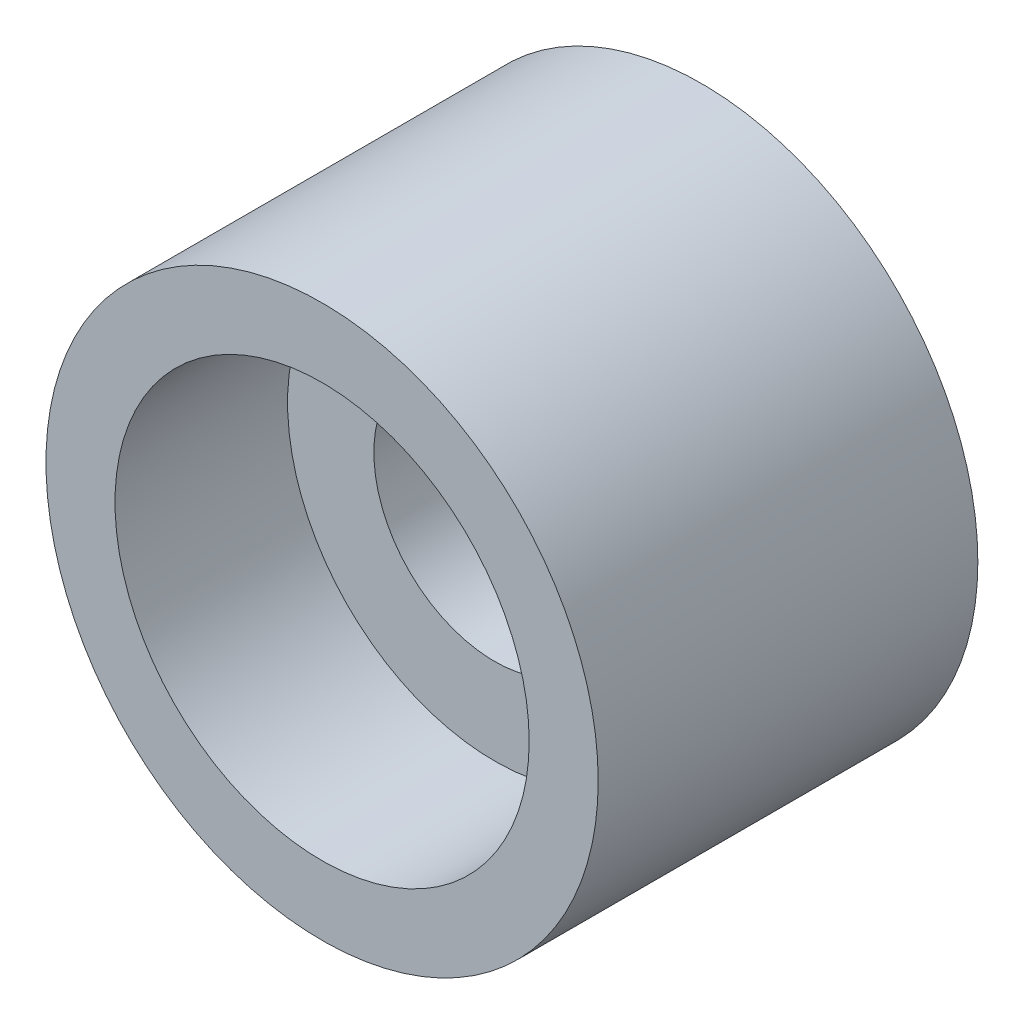
ISO-10303-21;
HEADER;
FILE_DESCRIPTION(('STEP AP214'),'2;1');
FILE_NAME('part.step','',(''),(''),'','','');
FILE_SCHEMA(('AUTOMOTIVE_DESIGN { 1 0 10303 214 1 1 1 1 }'));
ENDSEC;
DATA;
#1=APPLICATION_CONTEXT('core data for automotive mechanical design processes');
#2=APPLICATION_PROTOCOL_DEFINITION('international standard','automotive_design',2000,#1);
#3=PRODUCT_CONTEXT('',#1,'mechanical');
#4=PRODUCT('Part','Part','',(#3));
#5=PRODUCT_RELATED_PRODUCT_CATEGORY('part','',(#4));
#6=PRODUCT_DEFINITION_FORMATION('','',#4);
#7=PRODUCT_DEFINITION_CONTEXT('part definition',#1,'design');
#8=PRODUCT_DEFINITION('design','',#6,#7);
#9=PRODUCT_DEFINITION_SHAPE('','',#8);
#10=(LENGTH_UNIT() NAMED_UNIT(*) SI_UNIT(.MILLI.,.METRE.));
#11=(NAMED_UNIT(*) PLANE_ANGLE_UNIT() SI_UNIT($,.RADIAN.));
#12=(NAMED_UNIT(*) SI_UNIT($,.STERADIAN.) SOLID_ANGLE_UNIT());
#13=UNCERTAINTY_MEASURE_WITH_UNIT(LENGTH_MEASURE(1.E-05),#10,'distance_accuracy_value','');
#14=(GEOMETRIC_REPRESENTATION_CONTEXT(3) GLOBAL_UNCERTAINTY_ASSIGNED_CONTEXT((#13)) GLOBAL_UNIT_ASSIGNED_CONTEXT((#10,
#11,#12)) REPRESENTATION_CONTEXT('',''));
#15=CARTESIAN_POINT('',(0.,0.,0.));
#16=DIRECTION('',(0.,0.,1.));
#17=DIRECTION('',(1.,0.,0.));
#18=AXIS2_PLACEMENT_3D('',#15,#16,#17);
#19=CARTESIAN_POINT('',(0.,0.,3.));
#20=DIRECTION('',(0.,0.,1.));
#21=DIRECTION('',(1.,0.,0.));
#22=AXIS2_PLACEMENT_3D('',#19,#20,#21);
#23=PLANE('',#22);
#24=CARTESIAN_POINT('',(0.,0.,3.));
#25=DIRECTION('',(0.,0.,1.));
#26=DIRECTION('',(1.,0.,0.));
#27=AXIS2_PLACEMENT_3D('',#24,#25,#26);
#28=CIRCLE('',#27,3.);
#29=CARTESIAN_POINT('',(3.,0.,3.));
#30=VERTEX_POINT('',#29);
#31=EDGE_CURVE('E10',#30,#30,#28,.F.);
#32=ORIENTED_EDGE('',*,*,#31,.F.);
#33=EDGE_LOOP('',(#32));
#34=FACE_BOUND('',#33,.T.);
#35=CARTESIAN_POINT('',(0.,0.,3.));
#36=DIRECTION('',(0.,0.,1.));
#37=DIRECTION('',(1.,0.,0.));
#38=AXIS2_PLACEMENT_3D('',#35,#36,#37);
#39=CIRCLE('',#38,1.75);
#40=CARTESIAN_POINT('',(1.75,0.,3.));
#41=VERTEX_POINT('',#40);
#42=EDGE_CURVE('E43',#41,#41,#39,.T.);
#43=ORIENTED_EDGE('',*,*,#42,.F.);
#44=EDGE_LOOP('',(#43));
#45=FACE_BOUND('',#44,.T.);
#46=ADVANCED_FACE('F31',(#34,#45),#23,.T.);
#47=CARTESIAN_POINT('',(0.,0.,0.));
#48=DIRECTION('',(0.,0.,1.));
#49=DIRECTION('',(1.,0.,0.));
#50=AXIS2_PLACEMENT_3D('',#47,#48,#49);
#51=PLANE('',#50);
#52=CARTESIAN_POINT('',(0.,0.,0.));
#53=DIRECTION('',(0.,0.,1.));
#54=DIRECTION('',(1.,0.,0.));
#55=AXIS2_PLACEMENT_3D('',#52,#53,#54);
#56=CIRCLE('',#55,4.);
#57=CARTESIAN_POINT('',(4.,0.,0.));
#58=VERTEX_POINT('',#57);
#59=EDGE_CURVE('E39',#58,#58,#56,.T.);
#60=ORIENTED_EDGE('',*,*,#59,.F.);
#61=EDGE_LOOP('',(#60));
#62=FACE_BOUND('',#61,.T.);
#63=CARTESIAN_POINT('',(0.,0.,0.));
#64=DIRECTION('',(0.,0.,1.));
#65=DIRECTION('',(1.,0.,0.));
#66=AXIS2_PLACEMENT_3D('',#63,#64,#65);
#67=CIRCLE('',#66,1.75);
#68=CARTESIAN_POINT('',(1.75,0.,0.));
#69=VERTEX_POINT('',#68);
#70=EDGE_CURVE('E47',#69,#69,#67,.T.);
#71=ORIENTED_EDGE('',*,*,#70,.T.);
#72=EDGE_LOOP('',(#71));
#73=FACE_BOUND('',#72,.T.);
#74=ADVANCED_FACE('F88',(#62,#73),#51,.F.);
#75=CARTESIAN_POINT('',(0.,0.,3.));
#76=DIRECTION('',(0.,0.,-1.));
#77=DIRECTION('',(-1.,0.,0.));
#78=AXIS2_PLACEMENT_3D('',#75,#76,#77);
#79=CYLINDRICAL_SURFACE('',#78,4.);
#80=CARTESIAN_POINT('',(0.932613213836867,-3.88975996603606,1.5));
#81=CARTESIAN_POINT('',(0.932611601497733,-3.88976090522241,1.45554849961442));
#82=CARTESIAN_POINT('',(0.928923852394566,-3.89065022868961,1.41107630135481));
#83=CARTESIAN_POINT('',(0.91428040517545,-3.89411682507593,1.32338999590528));
#84=CARTESIAN_POINT('',(0.903318891538184,-3.89669544860345,1.28017692429515));
#85=CARTESIAN_POINT('',(0.87447501795473,-3.9032692191638,1.19629015730966));
#86=CARTESIAN_POINT('',(0.856599541703767,-3.90726295694658,1.15561398277206));
#87=CARTESIAN_POINT('',(0.814444378892575,-3.91626643942841,1.07786012424431));
#88=CARTESIAN_POINT('',(0.7901650497694,-3.92127612741763,1.04078223957019));
#89=CARTESIAN_POINT('',(0.735513519829643,-3.93189552304348,0.970751196916405));
#90=CARTESIAN_POINT('',(0.705067935082605,-3.93751203605064,0.937856329692689));
#91=CARTESIAN_POINT('',(0.639092602583028,-3.94875656510582,0.877633973136957));
#92=CARTESIAN_POINT('',(0.603562498738439,-3.95438458193228,0.850306874066288));
#93=CARTESIAN_POINT('',(0.5280298571732,-3.96517972488418,0.801769585897201));
#94=CARTESIAN_POINT('',(0.487991036216633,-3.97034240623526,0.780614788946684));
#95=CARTESIAN_POINT('',(0.404805514234827,-3.97968365160796,0.745380050361506));
#96=CARTESIAN_POINT('',(0.361659104557738,-3.98386230772923,0.731299446479216));
#97=CARTESIAN_POINT('',(0.274078958291291,-3.99083752834648,0.710794245104304));
#98=CARTESIAN_POINT('',(0.229669673579582,-3.99365157759681,0.7042712179432));
#99=CARTESIAN_POINT('',(0.140319269550402,-3.99778810384624,0.698759238529355));
#100=CARTESIAN_POINT('',(0.0953782018979144,-3.99911072456104,0.699769560283349));
#101=CARTESIAN_POINT('',(0.00691698313752567,-4.00023525260167,0.70922094417245));
#102=CARTESIAN_POINT('',(-0.0366142888927465,-4.00005854787314,0.717555981734285));
#103=CARTESIAN_POINT('',(-0.121692041237425,-3.99837499290008,0.74125202596712));
#104=CARTESIAN_POINT('',(-0.163238442065054,-3.99686808943297,0.756613313753505));
#105=CARTESIAN_POINT('',(-0.243462251550346,-3.99278738692268,0.79402403211782));
#106=CARTESIAN_POINT('',(-0.282119930010285,-3.99020692421686,0.816115000883916));
#107=CARTESIAN_POINT('',(-0.355241208099461,-3.98436333258035,0.866327261789285));
#108=CARTESIAN_POINT('',(-0.389704324415097,-3.98110012509873,0.894449247816418));
#109=CARTESIAN_POINT('',(-0.454077771003557,-3.97427743700286,0.956506897686783));
#110=CARTESIAN_POINT('',(-0.483898277287227,-3.97071378376234,0.990535349383676));
#111=CARTESIAN_POINT('',(-0.537414351878906,-3.9638259328621,1.06313315396061));
#112=CARTESIAN_POINT('',(-0.561109804340658,-3.96050173973228,1.10170259270656));
#113=CARTESIAN_POINT('',(-0.601722329335953,-3.95453593799222,1.18241666545745));
#114=CARTESIAN_POINT('',(-0.618624786886195,-3.95189580541074,1.22456877411173));
#115=CARTESIAN_POINT('',(-0.645042449625944,-3.94767032949601,1.31117705897919));
#116=CARTESIAN_POINT('',(-0.654558617602301,-3.94608484869504,1.35563293409527));
#117=CARTESIAN_POINT('',(-0.665792613018097,-3.94420491939814,1.44477188639924));
#118=CARTESIAN_POINT('',(-0.667641093419723,-3.94388884396406,1.48943805944827));
#119=CARTESIAN_POINT('',(-0.663837719081638,-3.94453078092343,1.57843857855975));
#120=CARTESIAN_POINT('',(-0.65818628964889,-3.94548872106965,1.62277294329509));
#121=CARTESIAN_POINT('',(-0.639659509778759,-3.94853410110952,1.70941491223379));
#122=CARTESIAN_POINT('',(-0.626853948425632,-3.95061062226391,1.75173787442861));
#123=CARTESIAN_POINT('',(-0.594464127320188,-3.95561364473294,1.83365062322299));
#124=CARTESIAN_POINT('',(-0.574879309156978,-3.95854021606346,1.87324018434857));
#125=CARTESIAN_POINT('',(-0.529201449660236,-3.96490636453741,1.94913048796013));
#126=CARTESIAN_POINT('',(-0.503026905560537,-3.96835213114539,1.98538163704066));
#127=CARTESIAN_POINT('',(-0.445034064735638,-3.97527301087596,2.05304664960073));
#128=CARTESIAN_POINT('',(-0.413215187149352,-3.97874812698383,2.0844600145994));
#129=CARTESIAN_POINT('',(-0.344264510899848,-3.98531017978837,2.14205004734846));
#130=CARTESIAN_POINT('',(-0.30705865168011,-3.98839033860635,2.16813892371999));
#131=CARTESIAN_POINT('',(-0.228743331296409,-3.99364675951559,2.21371670519966));
#132=CARTESIAN_POINT('',(-0.187634034158392,-3.99582305956716,2.23320588747582));
#133=CARTESIAN_POINT('',(-0.102920273262336,-3.99889884133192,2.2649030973973));
#134=CARTESIAN_POINT('',(-0.0593315441801701,-3.99980560472754,2.27715241458099));
#135=CARTESIAN_POINT('',(0.0292886173209452,-4.00013798401781,2.29415299813107));
#136=CARTESIAN_POINT('',(0.0743198753105035,-3.99956377832735,2.29890516758054));
#137=CARTESIAN_POINT('',(0.163705871825794,-3.99689445877422,2.3007415847703));
#138=CARTESIAN_POINT('',(0.20805874708385,-3.99482598436423,2.29795782436496));
#139=CARTESIAN_POINT('',(0.295602691712552,-3.98930359594298,2.28509283956174));
#140=CARTESIAN_POINT('',(0.33879377568456,-3.98584969935236,2.27501170692153));
#141=CARTESIAN_POINT('',(0.422711597978297,-3.97782467668736,2.24789680632668));
#142=CARTESIAN_POINT('',(0.46344371580826,-3.97325610851898,2.23087889749505));
#143=CARTESIAN_POINT('',(0.541464315888177,-3.9633779292023,2.19039020693527));
#144=CARTESIAN_POINT('',(0.578752525697985,-3.95806825951034,2.16691891527702));
#145=CARTESIAN_POINT('',(0.649487474523809,-3.94708366104805,2.11374449035033));
#146=CARTESIAN_POINT('',(0.682862536853944,-3.94140422163191,2.08394693089058));
#147=CARTESIAN_POINT('',(0.744186754342728,-3.93028748483718,2.01915980792338));
#148=CARTESIAN_POINT('',(0.772134622569896,-3.92485024512554,1.98416901642501));
#149=CARTESIAN_POINT('',(0.822109747379236,-3.91468960137373,1.90953654663985));
#150=CARTESIAN_POINT('',(0.844069987321351,-3.90997451728596,1.8698488310717));
#151=CARTESIAN_POINT('',(0.881012102193239,-3.90181732541837,1.78725378136024));
#152=CARTESIAN_POINT('',(0.896000307366474,-3.89837406347789,1.74434940904166));
#153=CARTESIAN_POINT('',(0.915675640286949,-3.893791260574,1.66779003565074));
#154=CARTESIAN_POINT('',(0.922016058450731,-3.8922879373223,1.63457166439083));
#155=CARTESIAN_POINT('',(0.930485385487263,-3.89027195014103,1.56757283635709));
#156=CARTESIAN_POINT('',(0.93261443955044,-3.88975925205882,1.53379239900146));
#157=CARTESIAN_POINT('',(0.932613213836867,-3.88975996603606,1.5));
#158=B_SPLINE_CURVE_WITH_KNOTS('',3,(#80,#81,#82,#83,#84,#85,#86,#87,#88,#89,#90,#91,#92,#93,
#94,#95,#96,#97,#98,#99,#100,#101,#102,#103,#104,#105,#106,#107,#108,#109,#110,#111,#112,#113,
#114,#115,#116,#117,#118,#119,#120,#121,#122,#123,#124,#125,#126,#127,#128,#129,#130,#131,#132,
#133,#134,#135,#136,#137,#138,#139,#140,#141,#142,#143,#144,#145,#146,#147,#148,#149,#150,#151,
#152,#153,#154,#155,#156,#157),.UNSPECIFIED.,.T.,.F.,(4,2,2,2,2,2,2,2,2,2,2,2,2,2,2,2,2,2,2,2,2,
2,2,2,2,2,2,2,2,2,2,2,2,2,2,2,2,2,4),(0.,0.133230771085219,0.26656819140741,0.399773198332441,
0.532970771867862,0.667858020367463,0.802754720263344,0.938827203479569,1.07488694595244,
1.20915399104461,1.34340809690995,1.47575031704826,1.60809783256996,1.74127939375839,
1.87447628614049,2.00999477407982,2.14551582496172,2.28132690536217,2.41712028010815,
2.5505900624167,2.68405227620732,2.8162347342465,2.94842808281514,3.08234447817612,
3.21627466294162,3.35226081384755,3.48824125302078,3.62343850860915,3.75861947751297,
3.89144813929743,4.024275130914,4.15680013658356,4.28933561705741,4.42400921618471,
4.55871471109819,4.69487118861227,4.8309038006914,4.9321904290751,5.03347356545365),.UNSPECIFIED.);
#159=CARTESIAN_POINT('',(0.932613213836867,-3.88975996603606,1.5));
#160=VERTEX_POINT('',#159);
#161=EDGE_CURVE('E58',#160,#160,#158,.T.);
#162=ORIENTED_EDGE('',*,*,#161,.T.);
#163=EDGE_LOOP('',(#162));
#164=FACE_BOUND('',#163,.T.);
#165=ORIENTED_EDGE('',*,*,#59,.T.);
#166=EDGE_LOOP('',(#165));
#167=FACE_BOUND('',#166,.T.);
#168=CARTESIAN_POINT('',(0.,0.,5.5));
#169=DIRECTION('',(0.,0.,1.));
#170=DIRECTION('',(1.,0.,0.));
#171=AXIS2_PLACEMENT_3D('',#168,#169,#170);
#172=CIRCLE('',#171,4.);
#173=CARTESIAN_POINT('',(4.,0.,5.5));
#174=VERTEX_POINT('',#173);
#175=EDGE_CURVE('E51',#174,#174,#172,.T.);
#176=ORIENTED_EDGE('',*,*,#175,.F.);
#177=EDGE_LOOP('',(#176));
#178=FACE_BOUND('',#177,.T.);
#179=ADVANCED_FACE('F33',(#164,#167,#178),#79,.T.);
#180=CARTESIAN_POINT('',(0.,0.,3.));
#181=DIRECTION('',(0.,0.,-1.));
#182=DIRECTION('',(-1.,0.,0.));
#183=AXIS2_PLACEMENT_3D('',#180,#181,#182);
#184=CYLINDRICAL_SURFACE('',#183,1.75);
#185=CARTESIAN_POINT('',(0.852387018232029,-1.52837703828261,1.5));
#186=CARTESIAN_POINT('',(0.852384817945411,-1.52837970281062,1.45778495316443));
#187=CARTESIAN_POINT('',(0.84908513062133,-1.53023293278412,1.41550472635909));
#188=CARTESIAN_POINT('',(0.836030336875847,-1.5374022877934,1.33220020462497));
#189=CARTESIAN_POINT('',(0.826259454723989,-1.54272687494199,1.29117923591791));
#190=CARTESIAN_POINT('',(0.800728289470568,-1.55612951149121,1.21175012983708));
#191=CARTESIAN_POINT('',(0.784995815817549,-1.56419475857854,1.17333082252635));
#192=CARTESIAN_POINT('',(0.748050996116917,-1.58219483528755,1.0997308270703));
#193=CARTESIAN_POINT('',(0.726839180206835,-1.59212948401556,1.06454982605862));
#194=CARTESIAN_POINT('',(0.677807420609522,-1.61364201019623,0.99575893399544));
#195=CARTESIAN_POINT('',(0.649634869972045,-1.62528579326483,0.962420848079775));
#196=CARTESIAN_POINT('',(0.588176889562603,-1.64852269956874,0.900800404006014));
#197=CARTESIAN_POINT('',(0.554889251545673,-1.66011579868944,0.872520240879173));
#198=CARTESIAN_POINT('',(0.481908996684588,-1.68279508732706,0.820329014570099));
#199=CARTESIAN_POINT('',(0.441967294677159,-1.6938199207277,0.796737096720972));
#200=CARTESIAN_POINT('',(0.358081493367781,-1.71351363232638,0.756787577891677));
#201=CARTESIAN_POINT('',(0.314139530640908,-1.7221837584513,0.740426142069765));
#202=CARTESIAN_POINT('',(0.226331671335239,-1.73583572138983,0.716428991503449));
#203=CARTESIAN_POINT('',(0.182625407573443,-1.74101066235729,0.70832091629485));
#204=CARTESIAN_POINT('',(0.0942169219672954,-1.74802334838509,0.699520671848029));
#205=CARTESIAN_POINT('',(0.0495152041392732,-1.74986274507678,0.698824831527908));
#206=CARTESIAN_POINT('',(-0.036126724724031,-1.75011307138237,0.704651290245846));
#207=CARTESIAN_POINT('',(-0.0771033442098851,-1.74876443818711,0.710650460537884));
#208=CARTESIAN_POINT('',(-0.157484817257746,-1.7433650546478,0.728781699015403));
#209=CARTESIAN_POINT('',(-0.196889554002377,-1.73931410387104,0.740914222099623));
#210=CARTESIAN_POINT('',(-0.273724621224476,-1.72890196228755,0.771089453362653));
#211=CARTESIAN_POINT('',(-0.311116178181164,-1.72250682758488,0.789218595744018));
#212=CARTESIAN_POINT('',(-0.38248021627184,-1.70807971747166,0.830775255886455));
#213=CARTESIAN_POINT('',(-0.416451437646712,-1.70004714223883,0.854204715589977));
#214=CARTESIAN_POINT('',(-0.482968468637708,-1.68241516132379,0.907926573800167));
#215=CARTESIAN_POINT('',(-0.515166945002259,-1.67274121507567,0.938625065477214));
#216=CARTESIAN_POINT('',(-0.574128997336013,-1.6534329165143,1.00489926868235));
#217=CARTESIAN_POINT('',(-0.6008895585813,-1.64379858904916,1.04047766737395));
#218=CARTESIAN_POINT('',(-0.64937298702756,-1.6252754481917,1.11754261290331));
#219=CARTESIAN_POINT('',(-0.67080634870494,-1.61644156418817,1.15922605233847));
#220=CARTESIAN_POINT('',(-0.706114690380789,-1.60133537777784,1.24610620459552));
#221=CARTESIAN_POINT('',(-0.719996322124462,-1.59506082227611,1.29129978536512));
#222=CARTESIAN_POINT('',(-0.738779827374733,-1.58644394299812,1.38040861617786));
#223=CARTESIAN_POINT('',(-0.744263960312272,-1.58384769442957,1.42417580219255));
#224=CARTESIAN_POINT('',(-0.74782462900088,-1.58217056833844,1.51206878521202));
#225=CARTESIAN_POINT('',(-0.745904742212474,-1.58308799308422,1.55619439875013));
#226=CARTESIAN_POINT('',(-0.735249411903947,-1.58806058078048,1.63963049883396));
#227=CARTESIAN_POINT('',(-0.727099130850528,-1.59184611128256,1.67903442933608));
#228=CARTESIAN_POINT('',(-0.705044011362558,-1.60173589348558,1.75588706362019));
#229=CARTESIAN_POINT('',(-0.691137627714577,-1.60784076777323,1.79333523934168));
#230=CARTESIAN_POINT('',(-0.657294101934859,-1.62197848214374,1.86713212438687));
#231=CARTESIAN_POINT('',(-0.637111178660018,-1.63008645539336,1.9033531187921));
#232=CARTESIAN_POINT('',(-0.591542134457451,-1.64717017717172,1.9721363993463));
#233=CARTESIAN_POINT('',(-0.566153491461446,-1.6561463452059,2.00469690017507));
#234=CARTESIAN_POINT('',(-0.507891280571864,-1.67498503436728,2.06868884695913));
#235=CARTESIAN_POINT('',(-0.474519226703814,-1.68484491425638,2.09966916202273));
#236=CARTESIAN_POINT('',(-0.40285754277046,-1.70340094523157,2.15575887406282));
#237=CARTESIAN_POINT('',(-0.364567034877234,-1.71209688801526,2.18086722076975));
#238=CARTESIAN_POINT('',(-0.283471926074788,-1.72738645778073,2.22469806954343));
#239=CARTESIAN_POINT('',(-0.24061906320337,-1.7339538571942,2.24334108924826));
#240=CARTESIAN_POINT('',(-0.152018432046977,-1.74395295671062,2.27303205208709));
#241=CARTESIAN_POINT('',(-0.106272802060194,-1.74738694467958,2.28408553527288));
#242=CARTESIAN_POINT('',(-0.0171950333652808,-1.75043659178132,2.29748671886674));
#243=CARTESIAN_POINT('',(0.0260325717100333,-1.75033893290961,2.30046691262322));
#244=CARTESIAN_POINT('',(0.112269274128942,-1.74692751394537,2.29941457618845));
#245=CARTESIAN_POINT('',(0.155278422602751,-1.74361454490998,2.29538377070787));
#246=CARTESIAN_POINT('',(0.237674437007281,-1.73425722419483,2.28087100150947));
#247=CARTESIAN_POINT('',(0.277135615803498,-1.72835421658063,2.27071381855106));
#248=CARTESIAN_POINT('',(0.353677006258787,-1.71433011927701,2.24462857351464));
#249=CARTESIAN_POINT('',(0.390756816386293,-1.70620865673198,2.22869954121511));
#250=CARTESIAN_POINT('',(0.463377012023179,-1.68797140218873,2.1907295878475));
#251=CARTESIAN_POINT('',(0.498769729629919,-1.6777814625959,2.16844273884388));
#252=CARTESIAN_POINT('',(0.565432651099769,-1.65650606172437,2.11872040252548));
#253=CARTESIAN_POINT('',(0.59670103014971,-1.64542020752341,2.09128264911733));
#254=CARTESIAN_POINT('',(0.656989283529083,-1.62234161461272,2.02935175203626));
#255=CARTESIAN_POINT('',(0.685602080212933,-1.61035061106202,1.99446035144067));
#256=CARTESIAN_POINT('',(0.73670246979574,-1.58762527738422,1.92003304463252));
#257=CARTESIAN_POINT('',(0.759185965124275,-1.5768917906546,1.88049405655736));
#258=CARTESIAN_POINT('',(0.797497702313922,-1.55787072623172,1.79729319130993));
#259=CARTESIAN_POINT('',(0.813263665919663,-1.54960624041214,1.75359714062442));
#260=CARTESIAN_POINT('',(0.83710902870861,-1.5368593643989,1.66371027870467));
#261=CARTESIAN_POINT('',(0.845214231246459,-1.53236428372129,1.61752840002367));
#262=CARTESIAN_POINT('',(0.85032168619523,-1.52952704783178,1.55917862715732));
#263=CARTESIAN_POINT('',(0.851095360286664,-1.5290967884062,1.54736195279184));
#264=CARTESIAN_POINT('',(0.852128344911047,-1.52852140419915,1.5236985655321));
#265=CARTESIAN_POINT('',(0.852387635961304,-1.52837629021781,1.51185185151707));
#266=CARTESIAN_POINT('',(0.852387018232029,-1.52837703828261,1.5));
#267=B_SPLINE_CURVE_WITH_KNOTS('',3,(#185,#186,#187,#188,#189,#190,#191,#192,#193,#194,#195,
#196,#197,#198,#199,#200,#201,#202,#203,#204,#205,#206,#207,#208,#209,#210,#211,#212,#213,#214,
#215,#216,#217,#218,#219,#220,#221,#222,#223,#224,#225,#226,#227,#228,#229,#230,#231,#232,#233,
#234,#235,#236,#237,#238,#239,#240,#241,#242,#243,#244,#245,#246,#247,#248,#249,#250,#251,#252,
#253,#254,#255,#256,#257,#258,#259,#260,#261,#262,#263,#264,#265,#266),.UNSPECIFIED.,.T.,.F.,(4,
2,2,2,2,2,2,2,2,2,2,2,2,2,2,2,2,2,2,2,2,2,2,2,2,2,2,2,2,2,2,2,2,2,2,2,2,2,2,2,4),(0.,
0.126595309747651,0.253500380088371,0.379820613054652,0.506128628855614,0.64107106237872,
0.77607191670295,0.918376432854154,1.06060538389617,1.19413781066874,1.32760409932131,
1.45132898604464,1.57506305054661,1.70066453399463,1.82631211034664,1.96229913795756,
2.09836135091834,2.2407032101141,2.38291948733494,2.51473940417494,2.64649563649377,
2.76720079244896,2.88793837248183,3.01417385365926,3.14047063855572,3.27960425030113,
3.41876272870435,3.55957590204308,3.70028617792545,3.82960203774854,3.95888609027979,
4.08185418474419,4.20484295918008,4.33344921030834,4.46211217374042,4.60154115305878,
4.74106311634897,4.8818518377485,5.022164639711,5.05770485821354,5.09324642280615),.UNSPECIFIED.);
#268=CARTESIAN_POINT('',(0.852387018232029,-1.52837703828261,1.5));
#269=VERTEX_POINT('',#268);
#270=EDGE_CURVE('E64',#269,#269,#267,.T.);
#271=ORIENTED_EDGE('',*,*,#270,.F.);
#272=EDGE_LOOP('',(#271));
#273=FACE_BOUND('',#272,.T.);
#274=ORIENTED_EDGE('',*,*,#42,.T.);
#275=EDGE_LOOP('',(#274));
#276=FACE_BOUND('',#275,.T.);
#277=ORIENTED_EDGE('',*,*,#70,.F.);
#278=EDGE_LOOP('',(#277));
#279=FACE_BOUND('',#278,.T.);
#280=ADVANCED_FACE('F82',(#273,#276,#279),#184,.F.);
#281=CARTESIAN_POINT('',(0.,0.,5.5));
#282=DIRECTION('',(0.,0.,1.));
#283=DIRECTION('',(1.,0.,0.));
#284=AXIS2_PLACEMENT_3D('',#281,#282,#283);
#285=PLANE('',#284);
#286=ORIENTED_EDGE('',*,*,#175,.T.);
#287=EDGE_LOOP('',(#286));
#288=FACE_BOUND('',#287,.T.);
#289=CARTESIAN_POINT('',(0.,0.,5.5));
#290=DIRECTION('',(0.,0.,1.));
#291=DIRECTION('',(1.,0.,0.));
#292=AXIS2_PLACEMENT_3D('',#289,#290,#291);
#293=CIRCLE('',#292,3.);
#294=CARTESIAN_POINT('',(3.,0.,5.5));
#295=VERTEX_POINT('',#294);
#296=EDGE_CURVE('E55',#295,#295,#293,.T.);
#297=ORIENTED_EDGE('',*,*,#296,.F.);
#298=EDGE_LOOP('',(#297));
#299=FACE_BOUND('',#298,.T.);
#300=ADVANCED_FACE('F78',(#288,#299),#285,.T.);
#301=CARTESIAN_POINT('',(0.,0.,5.5));
#302=DIRECTION('',(0.,0.,-1.));
#303=DIRECTION('',(-1.,0.,0.));
#304=AXIS2_PLACEMENT_3D('',#301,#302,#303);
#305=CYLINDRICAL_SURFACE('',#304,3.);
#306=ORIENTED_EDGE('',*,*,#296,.T.);
#307=EDGE_LOOP('',(#306));
#308=FACE_BOUND('',#307,.T.);
#309=ORIENTED_EDGE('',*,*,#31,.T.);
#310=EDGE_LOOP('',(#309));
#311=FACE_BOUND('',#310,.T.);
#312=ADVANCED_FACE('F71',(#308,#311),#305,.F.);
#313=CARTESIAN_POINT('',(0.135818607303778,-3.99769349824496,1.5));
#314=DIRECTION('',(0.0339546518259446,-0.999423374561241,0.));
#315=DIRECTION('',(0.999423374561241,0.0339546518259446,0.));
#316=AXIS2_PLACEMENT_3D('',#313,#314,#315);
#317=CYLINDRICAL_SURFACE('',#316,0.799999999999994);
#318=ORIENTED_EDGE('',*,*,#270,.T.);
#319=EDGE_LOOP('',(#318));
#320=FACE_BOUND('',#319,.T.);
#321=ORIENTED_EDGE('',*,*,#161,.F.);
#322=EDGE_LOOP('',(#321));
#323=FACE_BOUND('',#322,.T.);
#324=ADVANCED_FACE('F68',(#320,#323),#317,.F.);
#325=CLOSED_SHELL('',(#46,#74,#179,#280,#300,#312,#324));
#326=MANIFOLD_SOLID_BREP('B2',#325);
#327=ADVANCED_BREP_SHAPE_REPRESENTATION('',(#18,#326),#14);
#328=SHAPE_DEFINITION_REPRESENTATION(#9,#327);
ENDSEC;
END-ISO-10303-21;
